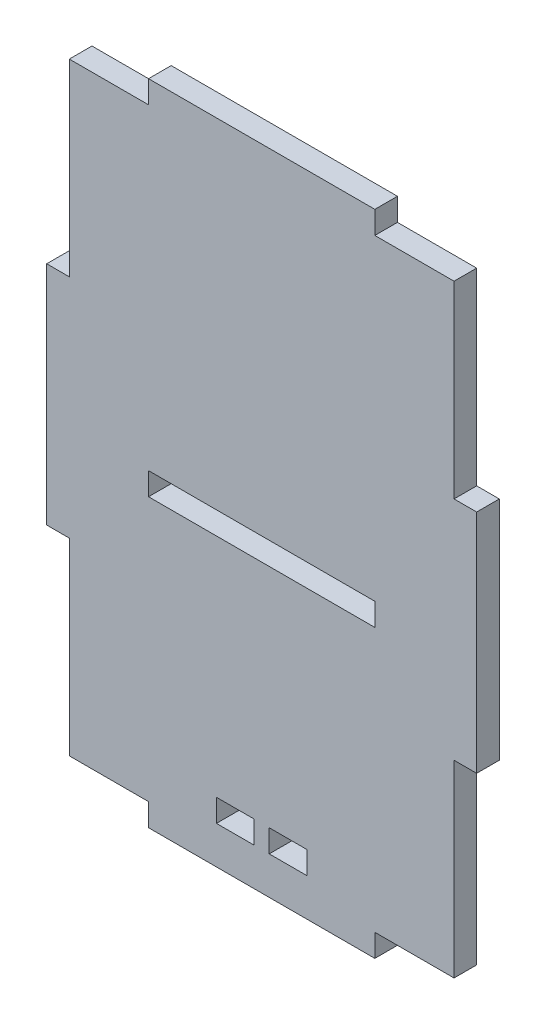
ISO-10303-21;
HEADER;
FILE_DESCRIPTION(('STEP AP214'),'2;1');
FILE_NAME('part.step','',(''),(''),'','','');
FILE_SCHEMA(('AUTOMOTIVE_DESIGN { 1 0 10303 214 1 1 1 1 }'));
ENDSEC;
DATA;
#1=APPLICATION_CONTEXT('core data for automotive mechanical design processes');
#2=APPLICATION_PROTOCOL_DEFINITION('international standard','automotive_design',2000,#1);
#3=PRODUCT_CONTEXT('',#1,'mechanical');
#4=PRODUCT('Part','Part','',(#3));
#5=PRODUCT_RELATED_PRODUCT_CATEGORY('part','',(#4));
#6=PRODUCT_DEFINITION_FORMATION('','',#4);
#7=PRODUCT_DEFINITION_CONTEXT('part definition',#1,'design');
#8=PRODUCT_DEFINITION('design','',#6,#7);
#9=PRODUCT_DEFINITION_SHAPE('','',#8);
#10=(LENGTH_UNIT() NAMED_UNIT(*) SI_UNIT(.MILLI.,.METRE.));
#11=(NAMED_UNIT(*) PLANE_ANGLE_UNIT() SI_UNIT($,.RADIAN.));
#12=(NAMED_UNIT(*) SI_UNIT($,.STERADIAN.) SOLID_ANGLE_UNIT());
#13=UNCERTAINTY_MEASURE_WITH_UNIT(LENGTH_MEASURE(1.E-05),#10,'distance_accuracy_value','');
#14=(GEOMETRIC_REPRESENTATION_CONTEXT(3) GLOBAL_UNCERTAINTY_ASSIGNED_CONTEXT((#13)) GLOBAL_UNIT_ASSIGNED_CONTEXT((#10,
#11,#12)) REPRESENTATION_CONTEXT('',''));
#15=CARTESIAN_POINT('',(0.,0.,0.));
#16=DIRECTION('',(0.,0.,1.));
#17=DIRECTION('',(1.,0.,0.));
#18=AXIS2_PLACEMENT_3D('',#15,#16,#17);
#19=CARTESIAN_POINT('',(0.,0.,1.5));
#20=DIRECTION('',(0.,0.,1.));
#21=DIRECTION('',(1.,0.,0.));
#22=AXIS2_PLACEMENT_3D('',#19,#20,#21);
#23=PLANE('',#22);
#24=DIRECTION('',(0.,1.,0.));
#25=VECTOR('',#24,1.);
#26=CARTESIAN_POINT('',(25.5,-15.,1.5));
#27=LINE('',#26,#25);
#28=CARTESIAN_POINT('',(25.5,-40.,1.5));
#29=VERTEX_POINT('',#28);
#30=CARTESIAN_POINT('',(25.5,-15.,1.5));
#31=VERTEX_POINT('',#30);
#32=EDGE_CURVE('E339',#29,#31,#27,.T.);
#33=ORIENTED_EDGE('',*,*,#32,.T.);
#34=DIRECTION('',(1.,0.,0.));
#35=VECTOR('',#34,1.);
#36=CARTESIAN_POINT('',(25.5,-15.,1.5));
#37=LINE('',#36,#35);
#38=CARTESIAN_POINT('',(28.5,-15.,1.5));
#39=VERTEX_POINT('',#38);
#40=EDGE_CURVE('E342',#31,#39,#37,.T.);
#41=ORIENTED_EDGE('',*,*,#40,.T.);
#42=DIRECTION('',(0.,1.,0.));
#43=VECTOR('',#42,1.);
#44=CARTESIAN_POINT('',(28.5,15.,1.5));
#45=LINE('',#44,#43);
#46=CARTESIAN_POINT('',(28.5,15.,1.5));
#47=VERTEX_POINT('',#46);
#48=EDGE_CURVE('E345',#39,#47,#45,.T.);
#49=ORIENTED_EDGE('',*,*,#48,.T.);
#50=DIRECTION('',(-1.,0.,0.));
#51=VECTOR('',#50,1.);
#52=CARTESIAN_POINT('',(25.5,15.,1.5));
#53=LINE('',#52,#51);
#54=CARTESIAN_POINT('',(25.5,15.,1.5));
#55=VERTEX_POINT('',#54);
#56=EDGE_CURVE('E347',#47,#55,#53,.T.);
#57=ORIENTED_EDGE('',*,*,#56,.T.);
#58=DIRECTION('',(0.,1.,0.));
#59=VECTOR('',#58,1.);
#60=CARTESIAN_POINT('',(25.5,40.,1.5));
#61=LINE('',#60,#59);
#62=CARTESIAN_POINT('',(25.5,40.,1.5));
#63=VERTEX_POINT('',#62);
#64=EDGE_CURVE('E349',#55,#63,#61,.T.);
#65=ORIENTED_EDGE('',*,*,#64,.T.);
#66=DIRECTION('',(-1.,0.,0.));
#67=VECTOR('',#66,1.);
#68=CARTESIAN_POINT('',(15.,40.,1.5));
#69=LINE('',#68,#67);
#70=CARTESIAN_POINT('',(15.,40.,1.5));
#71=VERTEX_POINT('',#70);
#72=EDGE_CURVE('E351',#63,#71,#69,.T.);
#73=ORIENTED_EDGE('',*,*,#72,.T.);
#74=DIRECTION('',(0.,1.,0.));
#75=VECTOR('',#74,1.);
#76=CARTESIAN_POINT('',(15.,40.,1.5));
#77=LINE('',#76,#75);
#78=CARTESIAN_POINT('',(15.,43.,1.5));
#79=VERTEX_POINT('',#78);
#80=EDGE_CURVE('E353',#71,#79,#77,.T.);
#81=ORIENTED_EDGE('',*,*,#80,.T.);
#82=DIRECTION('',(-1.,0.,0.));
#83=VECTOR('',#82,1.);
#84=CARTESIAN_POINT('',(-15.,43.,1.5));
#85=LINE('',#84,#83);
#86=CARTESIAN_POINT('',(-15.,43.,1.5));
#87=VERTEX_POINT('',#86);
#88=EDGE_CURVE('E355',#79,#87,#85,.T.);
#89=ORIENTED_EDGE('',*,*,#88,.T.);
#90=DIRECTION('',(0.,-1.,0.));
#91=VECTOR('',#90,1.);
#92=CARTESIAN_POINT('',(-15.,40.,1.5));
#93=LINE('',#92,#91);
#94=CARTESIAN_POINT('',(-15.,40.,1.5));
#95=VERTEX_POINT('',#94);
#96=EDGE_CURVE('E357',#87,#95,#93,.T.);
#97=ORIENTED_EDGE('',*,*,#96,.T.);
#98=DIRECTION('',(-1.,0.,0.));
#99=VECTOR('',#98,1.);
#100=CARTESIAN_POINT('',(-25.5,40.,1.5));
#101=LINE('',#100,#99);
#102=CARTESIAN_POINT('',(-25.5,40.,1.5));
#103=VERTEX_POINT('',#102);
#104=EDGE_CURVE('E359',#95,#103,#101,.T.);
#105=ORIENTED_EDGE('',*,*,#104,.T.);
#106=DIRECTION('',(0.,-1.,0.));
#107=VECTOR('',#106,1.);
#108=CARTESIAN_POINT('',(-25.5,40.,1.5));
#109=LINE('',#108,#107);
#110=CARTESIAN_POINT('',(-25.5,15.,1.5));
#111=VERTEX_POINT('',#110);
#112=EDGE_CURVE('E361',#103,#111,#109,.T.);
#113=ORIENTED_EDGE('',*,*,#112,.T.);
#114=DIRECTION('',(-1.,0.,0.));
#115=VECTOR('',#114,1.);
#116=CARTESIAN_POINT('',(-25.5,15.,1.5));
#117=LINE('',#116,#115);
#118=CARTESIAN_POINT('',(-28.5,15.,1.5));
#119=VERTEX_POINT('',#118);
#120=EDGE_CURVE('E363',#111,#119,#117,.T.);
#121=ORIENTED_EDGE('',*,*,#120,.T.);
#122=DIRECTION('',(0.,-1.,0.));
#123=VECTOR('',#122,1.);
#124=CARTESIAN_POINT('',(-28.5,15.,1.5));
#125=LINE('',#124,#123);
#126=CARTESIAN_POINT('',(-28.5,-15.,1.5));
#127=VERTEX_POINT('',#126);
#128=EDGE_CURVE('E365',#119,#127,#125,.T.);
#129=ORIENTED_EDGE('',*,*,#128,.T.);
#130=DIRECTION('',(1.,0.,0.));
#131=VECTOR('',#130,1.);
#132=CARTESIAN_POINT('',(-25.5,-15.,1.5));
#133=LINE('',#132,#131);
#134=CARTESIAN_POINT('',(-25.5,-15.,1.5));
#135=VERTEX_POINT('',#134);
#136=EDGE_CURVE('E367',#127,#135,#133,.T.);
#137=ORIENTED_EDGE('',*,*,#136,.T.);
#138=DIRECTION('',(0.,-1.,0.));
#139=VECTOR('',#138,1.);
#140=CARTESIAN_POINT('',(-25.5,-15.,1.5));
#141=LINE('',#140,#139);
#142=CARTESIAN_POINT('',(-25.5,-40.,1.5));
#143=VERTEX_POINT('',#142);
#144=EDGE_CURVE('E369',#135,#143,#141,.T.);
#145=ORIENTED_EDGE('',*,*,#144,.T.);
#146=DIRECTION('',(1.,0.,0.));
#147=VECTOR('',#146,1.);
#148=CARTESIAN_POINT('',(-25.5,-40.,1.5));
#149=LINE('',#148,#147);
#150=CARTESIAN_POINT('',(-15.,-40.,1.5));
#151=VERTEX_POINT('',#150);
#152=EDGE_CURVE('E371',#143,#151,#149,.T.);
#153=ORIENTED_EDGE('',*,*,#152,.T.);
#154=DIRECTION('',(0.,-1.,0.));
#155=VECTOR('',#154,1.);
#156=CARTESIAN_POINT('',(-15.,-40.,1.5));
#157=LINE('',#156,#155);
#158=CARTESIAN_POINT('',(-15.,-43.,1.5));
#159=VERTEX_POINT('',#158);
#160=EDGE_CURVE('E373',#151,#159,#157,.T.);
#161=ORIENTED_EDGE('',*,*,#160,.T.);
#162=DIRECTION('',(1.,0.,0.));
#163=VECTOR('',#162,1.);
#164=CARTESIAN_POINT('',(-15.,-43.,1.5));
#165=LINE('',#164,#163);
#166=CARTESIAN_POINT('',(15.,-43.,1.5));
#167=VERTEX_POINT('',#166);
#168=EDGE_CURVE('E375',#159,#167,#165,.T.);
#169=ORIENTED_EDGE('',*,*,#168,.T.);
#170=DIRECTION('',(0.,1.,0.));
#171=VECTOR('',#170,1.);
#172=CARTESIAN_POINT('',(15.,-40.,1.5));
#173=LINE('',#172,#171);
#174=CARTESIAN_POINT('',(15.,-40.,1.5));
#175=VERTEX_POINT('',#174);
#176=EDGE_CURVE('E377',#167,#175,#173,.T.);
#177=ORIENTED_EDGE('',*,*,#176,.T.);
#178=DIRECTION('',(1.,0.,0.));
#179=VECTOR('',#178,1.);
#180=CARTESIAN_POINT('',(15.,-40.,1.5));
#181=LINE('',#180,#179);
#182=EDGE_CURVE('E379',#175,#29,#181,.T.);
#183=ORIENTED_EDGE('',*,*,#182,.T.);
#184=EDGE_LOOP('',(#33,#41,#49,#57,#65,#73,#81,#89,#97,#105,#113,#121,#129,#137,#145,#153,#161,
#169,#177,#183));
#185=FACE_BOUND('',#184,.T.);
#186=DIRECTION('',(1.,0.,0.));
#187=VECTOR('',#186,1.);
#188=CARTESIAN_POINT('',(-15.,-5.,1.5));
#189=LINE('',#188,#187);
#190=CARTESIAN_POINT('',(-15.,-5.,1.5));
#191=VERTEX_POINT('',#190);
#192=CARTESIAN_POINT('',(15.,-5.,1.5));
#193=VERTEX_POINT('',#192);
#194=EDGE_CURVE('E310',#191,#193,#189,.T.);
#195=ORIENTED_EDGE('',*,*,#194,.F.);
#196=DIRECTION('',(0.,-1.,0.));
#197=VECTOR('',#196,1.);
#198=CARTESIAN_POINT('',(-15.,-2.,1.5));
#199=LINE('',#198,#197);
#200=CARTESIAN_POINT('',(-15.,-2.,1.5));
#201=VERTEX_POINT('',#200);
#202=EDGE_CURVE('E308',#201,#191,#199,.T.);
#203=ORIENTED_EDGE('',*,*,#202,.F.);
#204=DIRECTION('',(-1.,0.,0.));
#205=VECTOR('',#204,1.);
#206=CARTESIAN_POINT('',(-15.,-2.,1.5));
#207=LINE('',#206,#205);
#208=CARTESIAN_POINT('',(15.,-2.,1.5));
#209=VERTEX_POINT('',#208);
#210=EDGE_CURVE('E316',#209,#201,#207,.T.);
#211=ORIENTED_EDGE('',*,*,#210,.F.);
#212=DIRECTION('',(0.,1.,0.));
#213=VECTOR('',#212,1.);
#214=CARTESIAN_POINT('',(15.,-2.,1.5));
#215=LINE('',#214,#213);
#216=EDGE_CURVE('E313',#193,#209,#215,.T.);
#217=ORIENTED_EDGE('',*,*,#216,.F.);
#218=EDGE_LOOP('',(#195,#203,#211,#217));
#219=FACE_BOUND('',#218,.T.);
#220=DIRECTION('',(1.,0.,0.));
#221=VECTOR('',#220,1.);
#222=CARTESIAN_POINT('',(0.999999999999997,-38.,1.5));
#223=LINE('',#222,#221);
#224=CARTESIAN_POINT('',(0.999999999999997,-38.,1.5));
#225=VERTEX_POINT('',#224);
#226=CARTESIAN_POINT('',(6.,-38.,1.5));
#227=VERTEX_POINT('',#226);
#228=EDGE_CURVE('E279',#225,#227,#223,.T.);
#229=ORIENTED_EDGE('',*,*,#228,.F.);
#230=DIRECTION('',(0.,-1.,0.));
#231=VECTOR('',#230,1.);
#232=CARTESIAN_POINT('',(0.999999999999997,-38.,1.5));
#233=LINE('',#232,#231);
#234=CARTESIAN_POINT('',(0.999999999999997,-35.,1.5));
#235=VERTEX_POINT('',#234);
#236=EDGE_CURVE('E277',#235,#225,#233,.T.);
#237=ORIENTED_EDGE('',*,*,#236,.F.);
#238=DIRECTION('',(-1.,0.,0.));
#239=VECTOR('',#238,1.);
#240=CARTESIAN_POINT('',(0.999999999999997,-35.,1.5));
#241=LINE('',#240,#239);
#242=CARTESIAN_POINT('',(6.,-35.,1.5));
#243=VERTEX_POINT('',#242);
#244=EDGE_CURVE('E285',#243,#235,#241,.T.);
#245=ORIENTED_EDGE('',*,*,#244,.F.);
#246=DIRECTION('',(0.,1.,0.));
#247=VECTOR('',#246,1.);
#248=CARTESIAN_POINT('',(6.,-38.,1.5));
#249=LINE('',#248,#247);
#250=EDGE_CURVE('E282',#227,#243,#249,.T.);
#251=ORIENTED_EDGE('',*,*,#250,.F.);
#252=EDGE_LOOP('',(#229,#237,#245,#251));
#253=FACE_BOUND('',#252,.T.);
#254=DIRECTION('',(-1.,0.,0.));
#255=VECTOR('',#254,1.);
#256=CARTESIAN_POINT('',(-1.,-35.,1.5));
#257=LINE('',#256,#255);
#258=CARTESIAN_POINT('',(-1.,-35.,1.5));
#259=VERTEX_POINT('',#258);
#260=CARTESIAN_POINT('',(-6.,-35.,1.5));
#261=VERTEX_POINT('',#260);
#262=EDGE_CURVE('E249',#259,#261,#257,.T.);
#263=ORIENTED_EDGE('',*,*,#262,.F.);
#264=DIRECTION('',(0.,1.,0.));
#265=VECTOR('',#264,1.);
#266=CARTESIAN_POINT('',(-1.,-35.,1.5));
#267=LINE('',#266,#265);
#268=CARTESIAN_POINT('',(-1.,-38.,1.5));
#269=VERTEX_POINT('',#268);
#270=EDGE_CURVE('E241',#269,#259,#267,.T.);
#271=ORIENTED_EDGE('',*,*,#270,.F.);
#272=DIRECTION('',(1.,0.,0.));
#273=VECTOR('',#272,1.);
#274=CARTESIAN_POINT('',(-1.,-38.,1.5));
#275=LINE('',#274,#273);
#276=CARTESIAN_POINT('',(-6.,-38.,1.5));
#277=VERTEX_POINT('',#276);
#278=EDGE_CURVE('E263',#277,#269,#275,.T.);
#279=ORIENTED_EDGE('',*,*,#278,.F.);
#280=DIRECTION('',(0.,-1.,0.));
#281=VECTOR('',#280,1.);
#282=CARTESIAN_POINT('',(-6.,-35.,1.5));
#283=LINE('',#282,#281);
#284=EDGE_CURVE('E261',#261,#277,#283,.T.);
#285=ORIENTED_EDGE('',*,*,#284,.F.);
#286=EDGE_LOOP('',(#263,#271,#279,#285));
#287=FACE_BOUND('',#286,.T.);
#288=ADVANCED_FACE('F32',(#185,#219,#253,#287),#23,.T.);
#289=CARTESIAN_POINT('',(0.,0.,-1.5));
#290=DIRECTION('',(0.,0.,1.));
#291=DIRECTION('',(1.,0.,0.));
#292=AXIS2_PLACEMENT_3D('',#289,#290,#291);
#293=PLANE('',#292);
#294=DIRECTION('',(0.,-1.,0.));
#295=VECTOR('',#294,1.);
#296=CARTESIAN_POINT('',(0.999999999999997,-38.,-1.5));
#297=LINE('',#296,#295);
#298=CARTESIAN_POINT('',(0.999999999999997,-35.,-1.5));
#299=VERTEX_POINT('',#298);
#300=CARTESIAN_POINT('',(0.999999999999997,-38.,-1.5));
#301=VERTEX_POINT('',#300);
#302=EDGE_CURVE('E257',#299,#301,#297,.T.);
#303=ORIENTED_EDGE('',*,*,#302,.T.);
#304=DIRECTION('',(1.,0.,0.));
#305=VECTOR('',#304,1.);
#306=CARTESIAN_POINT('',(0.999999999999997,-38.,-1.5));
#307=LINE('',#306,#305);
#308=CARTESIAN_POINT('',(6.,-38.,-1.5));
#309=VERTEX_POINT('',#308);
#310=EDGE_CURVE('E290',#301,#309,#307,.T.);
#311=ORIENTED_EDGE('',*,*,#310,.T.);
#312=DIRECTION('',(0.,1.,0.));
#313=VECTOR('',#312,1.);
#314=CARTESIAN_POINT('',(6.,-38.,-1.5));
#315=LINE('',#314,#313);
#316=CARTESIAN_POINT('',(6.,-35.,-1.5));
#317=VERTEX_POINT('',#316);
#318=EDGE_CURVE('E293',#309,#317,#315,.T.);
#319=ORIENTED_EDGE('',*,*,#318,.T.);
#320=DIRECTION('',(-1.,0.,0.));
#321=VECTOR('',#320,1.);
#322=CARTESIAN_POINT('',(0.999999999999997,-35.,-1.5));
#323=LINE('',#322,#321);
#324=EDGE_CURVE('E280',#317,#299,#323,.T.);
#325=ORIENTED_EDGE('',*,*,#324,.T.);
#326=EDGE_LOOP('',(#303,#311,#319,#325));
#327=FACE_BOUND('',#326,.T.);
#328=DIRECTION('',(0.,1.,0.));
#329=VECTOR('',#328,1.);
#330=CARTESIAN_POINT('',(25.5,-15.,-1.5));
#331=LINE('',#330,#329);
#332=CARTESIAN_POINT('',(25.5,-40.,-1.5));
#333=VERTEX_POINT('',#332);
#334=CARTESIAN_POINT('',(25.5,-15.,-1.5));
#335=VERTEX_POINT('',#334);
#336=EDGE_CURVE('E338',#333,#335,#331,.T.);
#337=ORIENTED_EDGE('',*,*,#336,.F.);
#338=DIRECTION('',(1.,0.,0.));
#339=VECTOR('',#338,1.);
#340=CARTESIAN_POINT('',(15.,-40.,-1.5));
#341=LINE('',#340,#339);
#342=CARTESIAN_POINT('',(15.,-40.,-1.5));
#343=VERTEX_POINT('',#342);
#344=EDGE_CURVE('E343',#343,#333,#341,.T.);
#345=ORIENTED_EDGE('',*,*,#344,.F.);
#346=DIRECTION('',(0.,1.,0.));
#347=VECTOR('',#346,1.);
#348=CARTESIAN_POINT('',(15.,-40.,-1.5));
#349=LINE('',#348,#347);
#350=CARTESIAN_POINT('',(15.,-43.,-1.5));
#351=VERTEX_POINT('',#350);
#352=EDGE_CURVE('E418',#351,#343,#349,.T.);
#353=ORIENTED_EDGE('',*,*,#352,.F.);
#354=DIRECTION('',(1.,0.,0.));
#355=VECTOR('',#354,1.);
#356=CARTESIAN_POINT('',(-15.,-43.,-1.5));
#357=LINE('',#356,#355);
#358=CARTESIAN_POINT('',(-15.,-43.,-1.5));
#359=VERTEX_POINT('',#358);
#360=EDGE_CURVE('E416',#359,#351,#357,.T.);
#361=ORIENTED_EDGE('',*,*,#360,.F.);
#362=DIRECTION('',(0.,-1.,0.));
#363=VECTOR('',#362,1.);
#364=CARTESIAN_POINT('',(-15.,-40.,-1.5));
#365=LINE('',#364,#363);
#366=CARTESIAN_POINT('',(-15.,-40.,-1.5));
#367=VERTEX_POINT('',#366);
#368=EDGE_CURVE('E414',#367,#359,#365,.T.);
#369=ORIENTED_EDGE('',*,*,#368,.F.);
#370=DIRECTION('',(1.,0.,0.));
#371=VECTOR('',#370,1.);
#372=CARTESIAN_POINT('',(-25.5,-40.,-1.5));
#373=LINE('',#372,#371);
#374=CARTESIAN_POINT('',(-25.5,-40.,-1.5));
#375=VERTEX_POINT('',#374);
#376=EDGE_CURVE('E412',#375,#367,#373,.T.);
#377=ORIENTED_EDGE('',*,*,#376,.F.);
#378=DIRECTION('',(0.,-1.,0.));
#379=VECTOR('',#378,1.);
#380=CARTESIAN_POINT('',(-25.5,-15.,-1.5));
#381=LINE('',#380,#379);
#382=CARTESIAN_POINT('',(-25.5,-15.,-1.5));
#383=VERTEX_POINT('',#382);
#384=EDGE_CURVE('E410',#383,#375,#381,.T.);
#385=ORIENTED_EDGE('',*,*,#384,.F.);
#386=DIRECTION('',(1.,0.,0.));
#387=VECTOR('',#386,1.);
#388=CARTESIAN_POINT('',(-25.5,-15.,-1.5));
#389=LINE('',#388,#387);
#390=CARTESIAN_POINT('',(-28.5,-15.,-1.5));
#391=VERTEX_POINT('',#390);
#392=EDGE_CURVE('E408',#391,#383,#389,.T.);
#393=ORIENTED_EDGE('',*,*,#392,.F.);
#394=DIRECTION('',(0.,-1.,0.));
#395=VECTOR('',#394,1.);
#396=CARTESIAN_POINT('',(-28.5,15.,-1.5));
#397=LINE('',#396,#395);
#398=CARTESIAN_POINT('',(-28.5,15.,-1.5));
#399=VERTEX_POINT('',#398);
#400=EDGE_CURVE('E406',#399,#391,#397,.T.);
#401=ORIENTED_EDGE('',*,*,#400,.F.);
#402=DIRECTION('',(-1.,0.,0.));
#403=VECTOR('',#402,1.);
#404=CARTESIAN_POINT('',(-25.5,15.,-1.5));
#405=LINE('',#404,#403);
#406=CARTESIAN_POINT('',(-25.5,15.,-1.5));
#407=VERTEX_POINT('',#406);
#408=EDGE_CURVE('E404',#407,#399,#405,.T.);
#409=ORIENTED_EDGE('',*,*,#408,.F.);
#410=DIRECTION('',(0.,-1.,0.));
#411=VECTOR('',#410,1.);
#412=CARTESIAN_POINT('',(-25.5,40.,-1.5));
#413=LINE('',#412,#411);
#414=CARTESIAN_POINT('',(-25.5,40.,-1.5));
#415=VERTEX_POINT('',#414);
#416=EDGE_CURVE('E402',#415,#407,#413,.T.);
#417=ORIENTED_EDGE('',*,*,#416,.F.);
#418=DIRECTION('',(-1.,0.,0.));
#419=VECTOR('',#418,1.);
#420=CARTESIAN_POINT('',(-25.5,40.,-1.5));
#421=LINE('',#420,#419);
#422=CARTESIAN_POINT('',(-15.,40.,-1.5));
#423=VERTEX_POINT('',#422);
#424=EDGE_CURVE('E400',#423,#415,#421,.T.);
#425=ORIENTED_EDGE('',*,*,#424,.F.);
#426=DIRECTION('',(0.,-1.,0.));
#427=VECTOR('',#426,1.);
#428=CARTESIAN_POINT('',(-15.,40.,-1.5));
#429=LINE('',#428,#427);
#430=CARTESIAN_POINT('',(-15.,43.,-1.5));
#431=VERTEX_POINT('',#430);
#432=EDGE_CURVE('E398',#431,#423,#429,.T.);
#433=ORIENTED_EDGE('',*,*,#432,.F.);
#434=DIRECTION('',(-1.,0.,0.));
#435=VECTOR('',#434,1.);
#436=CARTESIAN_POINT('',(-15.,43.,-1.5));
#437=LINE('',#436,#435);
#438=CARTESIAN_POINT('',(15.,43.,-1.5));
#439=VERTEX_POINT('',#438);
#440=EDGE_CURVE('E396',#439,#431,#437,.T.);
#441=ORIENTED_EDGE('',*,*,#440,.F.);
#442=DIRECTION('',(0.,1.,0.));
#443=VECTOR('',#442,1.);
#444=CARTESIAN_POINT('',(15.,40.,-1.5));
#445=LINE('',#444,#443);
#446=CARTESIAN_POINT('',(15.,40.,-1.5));
#447=VERTEX_POINT('',#446);
#448=EDGE_CURVE('E394',#447,#439,#445,.T.);
#449=ORIENTED_EDGE('',*,*,#448,.F.);
#450=DIRECTION('',(-1.,0.,0.));
#451=VECTOR('',#450,1.);
#452=CARTESIAN_POINT('',(15.,40.,-1.5));
#453=LINE('',#452,#451);
#454=CARTESIAN_POINT('',(25.5,40.,-1.5));
#455=VERTEX_POINT('',#454);
#456=EDGE_CURVE('E392',#455,#447,#453,.T.);
#457=ORIENTED_EDGE('',*,*,#456,.F.);
#458=DIRECTION('',(0.,1.,0.));
#459=VECTOR('',#458,1.);
#460=CARTESIAN_POINT('',(25.5,40.,-1.5));
#461=LINE('',#460,#459);
#462=CARTESIAN_POINT('',(25.5,15.,-1.5));
#463=VERTEX_POINT('',#462);
#464=EDGE_CURVE('E390',#463,#455,#461,.T.);
#465=ORIENTED_EDGE('',*,*,#464,.F.);
#466=DIRECTION('',(-1.,0.,0.));
#467=VECTOR('',#466,1.);
#468=CARTESIAN_POINT('',(25.5,15.,-1.5));
#469=LINE('',#468,#467);
#470=CARTESIAN_POINT('',(28.5,15.,-1.5));
#471=VERTEX_POINT('',#470);
#472=EDGE_CURVE('E388',#471,#463,#469,.T.);
#473=ORIENTED_EDGE('',*,*,#472,.F.);
#474=DIRECTION('',(0.,1.,0.));
#475=VECTOR('',#474,1.);
#476=CARTESIAN_POINT('',(28.5,15.,-1.5));
#477=LINE('',#476,#475);
#478=CARTESIAN_POINT('',(28.5,-15.,-1.5));
#479=VERTEX_POINT('',#478);
#480=EDGE_CURVE('E386',#479,#471,#477,.T.);
#481=ORIENTED_EDGE('',*,*,#480,.F.);
#482=DIRECTION('',(1.,0.,0.));
#483=VECTOR('',#482,1.);
#484=CARTESIAN_POINT('',(25.5,-15.,-1.5));
#485=LINE('',#484,#483);
#486=EDGE_CURVE('E384',#335,#479,#485,.T.);
#487=ORIENTED_EDGE('',*,*,#486,.F.);
#488=EDGE_LOOP('',(#337,#345,#353,#361,#369,#377,#385,#393,#401,#409,#417,#425,#433,#441,#449,
#457,#465,#473,#481,#487));
#489=FACE_BOUND('',#488,.T.);
#490=DIRECTION('',(0.,-1.,0.));
#491=VECTOR('',#490,1.);
#492=CARTESIAN_POINT('',(-15.,-2.,-1.5));
#493=LINE('',#492,#491);
#494=CARTESIAN_POINT('',(-15.,-2.,-1.5));
#495=VERTEX_POINT('',#494);
#496=CARTESIAN_POINT('',(-15.,-5.,-1.5));
#497=VERTEX_POINT('',#496);
#498=EDGE_CURVE('E307',#495,#497,#493,.T.);
#499=ORIENTED_EDGE('',*,*,#498,.T.);
#500=DIRECTION('',(1.,0.,0.));
#501=VECTOR('',#500,1.);
#502=CARTESIAN_POINT('',(-15.,-5.,-1.5));
#503=LINE('',#502,#501);
#504=CARTESIAN_POINT('',(15.,-5.,-1.5));
#505=VERTEX_POINT('',#504);
#506=EDGE_CURVE('E321',#497,#505,#503,.T.);
#507=ORIENTED_EDGE('',*,*,#506,.T.);
#508=DIRECTION('',(0.,1.,0.));
#509=VECTOR('',#508,1.);
#510=CARTESIAN_POINT('',(15.,-2.,-1.5));
#511=LINE('',#510,#509);
#512=CARTESIAN_POINT('',(15.,-2.,-1.5));
#513=VERTEX_POINT('',#512);
#514=EDGE_CURVE('E324',#505,#513,#511,.T.);
#515=ORIENTED_EDGE('',*,*,#514,.T.);
#516=DIRECTION('',(-1.,0.,0.));
#517=VECTOR('',#516,1.);
#518=CARTESIAN_POINT('',(-15.,-2.,-1.5));
#519=LINE('',#518,#517);
#520=EDGE_CURVE('E311',#513,#495,#519,.T.);
#521=ORIENTED_EDGE('',*,*,#520,.T.);
#522=EDGE_LOOP('',(#499,#507,#515,#521));
#523=FACE_BOUND('',#522,.T.);
#524=DIRECTION('',(0.,1.,0.));
#525=VECTOR('',#524,1.);
#526=CARTESIAN_POINT('',(-1.,-35.,-1.5));
#527=LINE('',#526,#525);
#528=CARTESIAN_POINT('',(-1.,-38.,-1.5));
#529=VERTEX_POINT('',#528);
#530=CARTESIAN_POINT('',(-1.,-35.,-1.5));
#531=VERTEX_POINT('',#530);
#532=EDGE_CURVE('E55',#529,#531,#527,.T.);
#533=ORIENTED_EDGE('',*,*,#532,.T.);
#534=DIRECTION('',(-1.,0.,0.));
#535=VECTOR('',#534,1.);
#536=CARTESIAN_POINT('',(-1.,-35.,-1.5));
#537=LINE('',#536,#535);
#538=CARTESIAN_POINT('',(-6.,-35.,-1.5));
#539=VERTEX_POINT('',#538);
#540=EDGE_CURVE('E256',#531,#539,#537,.T.);
#541=ORIENTED_EDGE('',*,*,#540,.T.);
#542=DIRECTION('',(0.,-1.,0.));
#543=VECTOR('',#542,1.);
#544=CARTESIAN_POINT('',(-6.,-35.,-1.5));
#545=LINE('',#544,#543);
#546=CARTESIAN_POINT('',(-6.,-38.,-1.5));
#547=VERTEX_POINT('',#546);
#548=EDGE_CURVE('E269',#539,#547,#545,.T.);
#549=ORIENTED_EDGE('',*,*,#548,.T.);
#550=DIRECTION('',(1.,0.,0.));
#551=VECTOR('',#550,1.);
#552=CARTESIAN_POINT('',(-1.,-38.,-1.5));
#553=LINE('',#552,#551);
#554=EDGE_CURVE('E250',#547,#529,#553,.T.);
#555=ORIENTED_EDGE('',*,*,#554,.T.);
#556=EDGE_LOOP('',(#533,#541,#549,#555));
#557=FACE_BOUND('',#556,.T.);
#558=ADVANCED_FACE('F484',(#327,#489,#523,#557),#293,.F.);
#559=CARTESIAN_POINT('',(25.5,-15.,1.5));
#560=DIRECTION('',(-1.,0.,0.));
#561=DIRECTION('',(0.,-1.,0.));
#562=AXIS2_PLACEMENT_3D('',#559,#560,#561);
#563=PLANE('',#562);
#564=ORIENTED_EDGE('',*,*,#336,.T.);
#565=DIRECTION('',(0.,0.,-1.));
#566=VECTOR('',#565,1.);
#567=CARTESIAN_POINT('',(25.5,-15.,1.5));
#568=LINE('',#567,#566);
#569=EDGE_CURVE('E11',#31,#335,#568,.T.);
#570=ORIENTED_EDGE('',*,*,#569,.F.);
#571=ORIENTED_EDGE('',*,*,#32,.F.);
#572=DIRECTION('',(0.,0.,-1.));
#573=VECTOR('',#572,1.);
#574=CARTESIAN_POINT('',(25.5,-40.,1.5));
#575=LINE('',#574,#573);
#576=EDGE_CURVE('E381',#29,#333,#575,.T.);
#577=ORIENTED_EDGE('',*,*,#576,.T.);
#578=EDGE_LOOP('',(#564,#570,#571,#577));
#579=FACE_BOUND('',#578,.T.);
#580=ADVANCED_FACE('F34',(#579),#563,.F.);
#581=CARTESIAN_POINT('',(25.5,-15.,1.5));
#582=DIRECTION('',(0.,1.,0.));
#583=DIRECTION('',(0.,0.,1.));
#584=AXIS2_PLACEMENT_3D('',#581,#582,#583);
#585=PLANE('',#584);
#586=ORIENTED_EDGE('',*,*,#486,.T.);
#587=DIRECTION('',(0.,0.,-1.));
#588=VECTOR('',#587,1.);
#589=CARTESIAN_POINT('',(28.5,-15.,1.5));
#590=LINE('',#589,#588);
#591=EDGE_CURVE('E40',#39,#479,#590,.T.);
#592=ORIENTED_EDGE('',*,*,#591,.F.);
#593=ORIENTED_EDGE('',*,*,#40,.F.);
#594=ORIENTED_EDGE('',*,*,#569,.T.);
#595=EDGE_LOOP('',(#586,#592,#593,#594));
#596=FACE_BOUND('',#595,.T.);
#597=ADVANCED_FACE('F502',(#596),#585,.F.);
#598=CARTESIAN_POINT('',(28.5,15.,1.5));
#599=DIRECTION('',(-1.,0.,0.));
#600=DIRECTION('',(0.,-1.,0.));
#601=AXIS2_PLACEMENT_3D('',#598,#599,#600);
#602=PLANE('',#601);
#603=ORIENTED_EDGE('',*,*,#480,.T.);
#604=DIRECTION('',(0.,0.,-1.));
#605=VECTOR('',#604,1.);
#606=CARTESIAN_POINT('',(28.5,15.,1.5));
#607=LINE('',#606,#605);
#608=EDGE_CURVE('E471',#47,#471,#607,.T.);
#609=ORIENTED_EDGE('',*,*,#608,.F.);
#610=ORIENTED_EDGE('',*,*,#48,.F.);
#611=ORIENTED_EDGE('',*,*,#591,.T.);
#612=EDGE_LOOP('',(#603,#609,#610,#611));
#613=FACE_BOUND('',#612,.T.);
#614=ADVANCED_FACE('F478',(#613),#602,.F.);
#615=CARTESIAN_POINT('',(25.5,15.,1.5));
#616=DIRECTION('',(0.,-1.,0.));
#617=DIRECTION('',(1.,0.,0.));
#618=AXIS2_PLACEMENT_3D('',#615,#616,#617);
#619=PLANE('',#618);
#620=ORIENTED_EDGE('',*,*,#472,.T.);
#621=DIRECTION('',(0.,0.,-1.));
#622=VECTOR('',#621,1.);
#623=CARTESIAN_POINT('',(25.5,15.,1.5));
#624=LINE('',#623,#622);
#625=EDGE_CURVE('E468',#55,#463,#624,.T.);
#626=ORIENTED_EDGE('',*,*,#625,.F.);
#627=ORIENTED_EDGE('',*,*,#56,.F.);
#628=ORIENTED_EDGE('',*,*,#608,.T.);
#629=EDGE_LOOP('',(#620,#626,#627,#628));
#630=FACE_BOUND('',#629,.T.);
#631=ADVANCED_FACE('F490',(#630),#619,.F.);
#632=CARTESIAN_POINT('',(25.5,40.,1.5));
#633=DIRECTION('',(-1.,0.,0.));
#634=DIRECTION('',(0.,-1.,0.));
#635=AXIS2_PLACEMENT_3D('',#632,#633,#634);
#636=PLANE('',#635);
#637=ORIENTED_EDGE('',*,*,#464,.T.);
#638=DIRECTION('',(0.,0.,-1.));
#639=VECTOR('',#638,1.);
#640=CARTESIAN_POINT('',(25.5,40.,1.5));
#641=LINE('',#640,#639);
#642=EDGE_CURVE('E465',#63,#455,#641,.T.);
#643=ORIENTED_EDGE('',*,*,#642,.F.);
#644=ORIENTED_EDGE('',*,*,#64,.F.);
#645=ORIENTED_EDGE('',*,*,#625,.T.);
#646=EDGE_LOOP('',(#637,#643,#644,#645));
#647=FACE_BOUND('',#646,.T.);
#648=ADVANCED_FACE('F494',(#647),#636,.F.);
#649=CARTESIAN_POINT('',(15.,40.,1.5));
#650=DIRECTION('',(0.,-1.,0.));
#651=DIRECTION('',(0.,0.,-1.));
#652=AXIS2_PLACEMENT_3D('',#649,#650,#651);
#653=PLANE('',#652);
#654=ORIENTED_EDGE('',*,*,#456,.T.);
#655=DIRECTION('',(0.,0.,-1.));
#656=VECTOR('',#655,1.);
#657=CARTESIAN_POINT('',(15.,40.,1.5));
#658=LINE('',#657,#656);
#659=EDGE_CURVE('E462',#71,#447,#658,.T.);
#660=ORIENTED_EDGE('',*,*,#659,.F.);
#661=ORIENTED_EDGE('',*,*,#72,.F.);
#662=ORIENTED_EDGE('',*,*,#642,.T.);
#663=EDGE_LOOP('',(#654,#660,#661,#662));
#664=FACE_BOUND('',#663,.T.);
#665=ADVANCED_FACE('F575',(#664),#653,.F.);
#666=CARTESIAN_POINT('',(15.,40.,1.5));
#667=DIRECTION('',(-1.,0.,0.));
#668=DIRECTION('',(0.,0.,1.));
#669=AXIS2_PLACEMENT_3D('',#666,#667,#668);
#670=PLANE('',#669);
#671=ORIENTED_EDGE('',*,*,#448,.T.);
#672=DIRECTION('',(0.,0.,-1.));
#673=VECTOR('',#672,1.);
#674=CARTESIAN_POINT('',(15.,43.,1.5));
#675=LINE('',#674,#673);
#676=EDGE_CURVE('E459',#79,#439,#675,.T.);
#677=ORIENTED_EDGE('',*,*,#676,.F.);
#678=ORIENTED_EDGE('',*,*,#80,.F.);
#679=ORIENTED_EDGE('',*,*,#659,.T.);
#680=EDGE_LOOP('',(#671,#677,#678,#679));
#681=FACE_BOUND('',#680,.T.);
#682=ADVANCED_FACE('F573',(#681),#670,.F.);
#683=CARTESIAN_POINT('',(-15.,43.,1.5));
#684=DIRECTION('',(0.,-1.,0.));
#685=DIRECTION('',(0.,0.,-1.));
#686=AXIS2_PLACEMENT_3D('',#683,#684,#685);
#687=PLANE('',#686);
#688=ORIENTED_EDGE('',*,*,#440,.T.);
#689=DIRECTION('',(0.,0.,-1.));
#690=VECTOR('',#689,1.);
#691=CARTESIAN_POINT('',(-15.,43.,1.5));
#692=LINE('',#691,#690);
#693=EDGE_CURVE('E456',#87,#431,#692,.T.);
#694=ORIENTED_EDGE('',*,*,#693,.F.);
#695=ORIENTED_EDGE('',*,*,#88,.F.);
#696=ORIENTED_EDGE('',*,*,#676,.T.);
#697=EDGE_LOOP('',(#688,#694,#695,#696));
#698=FACE_BOUND('',#697,.T.);
#699=ADVANCED_FACE('F568',(#698),#687,.F.);
#700=CARTESIAN_POINT('',(-15.,40.,1.5));
#701=DIRECTION('',(1.,0.,0.));
#702=DIRECTION('',(0.,1.,0.));
#703=AXIS2_PLACEMENT_3D('',#700,#701,#702);
#704=PLANE('',#703);
#705=ORIENTED_EDGE('',*,*,#432,.T.);
#706=DIRECTION('',(0.,0.,-1.));
#707=VECTOR('',#706,1.);
#708=CARTESIAN_POINT('',(-15.,40.,1.5));
#709=LINE('',#708,#707);
#710=EDGE_CURVE('E453',#95,#423,#709,.T.);
#711=ORIENTED_EDGE('',*,*,#710,.F.);
#712=ORIENTED_EDGE('',*,*,#96,.F.);
#713=ORIENTED_EDGE('',*,*,#693,.T.);
#714=EDGE_LOOP('',(#705,#711,#712,#713));
#715=FACE_BOUND('',#714,.T.);
#716=ADVANCED_FACE('F563',(#715),#704,.F.);
#717=CARTESIAN_POINT('',(-25.5,40.,1.5));
#718=DIRECTION('',(0.,-1.,0.));
#719=DIRECTION('',(0.,0.,-1.));
#720=AXIS2_PLACEMENT_3D('',#717,#718,#719);
#721=PLANE('',#720);
#722=ORIENTED_EDGE('',*,*,#424,.T.);
#723=DIRECTION('',(0.,0.,-1.));
#724=VECTOR('',#723,1.);
#725=CARTESIAN_POINT('',(-25.5,40.,1.5));
#726=LINE('',#725,#724);
#727=EDGE_CURVE('E450',#103,#415,#726,.T.);
#728=ORIENTED_EDGE('',*,*,#727,.F.);
#729=ORIENTED_EDGE('',*,*,#104,.F.);
#730=ORIENTED_EDGE('',*,*,#710,.T.);
#731=EDGE_LOOP('',(#722,#728,#729,#730));
#732=FACE_BOUND('',#731,.T.);
#733=ADVANCED_FACE('F559',(#732),#721,.F.);
#734=CARTESIAN_POINT('',(-25.5,40.,1.5));
#735=DIRECTION('',(1.,0.,0.));
#736=DIRECTION('',(0.,1.,0.));
#737=AXIS2_PLACEMENT_3D('',#734,#735,#736);
#738=PLANE('',#737);
#739=ORIENTED_EDGE('',*,*,#416,.T.);
#740=DIRECTION('',(0.,0.,-1.));
#741=VECTOR('',#740,1.);
#742=CARTESIAN_POINT('',(-25.5,15.,1.5));
#743=LINE('',#742,#741);
#744=EDGE_CURVE('E447',#111,#407,#743,.T.);
#745=ORIENTED_EDGE('',*,*,#744,.F.);
#746=ORIENTED_EDGE('',*,*,#112,.F.);
#747=ORIENTED_EDGE('',*,*,#727,.T.);
#748=EDGE_LOOP('',(#739,#745,#746,#747));
#749=FACE_BOUND('',#748,.T.);
#750=ADVANCED_FACE('F554',(#749),#738,.F.);
#751=CARTESIAN_POINT('',(-25.5,15.,1.5));
#752=DIRECTION('',(0.,-1.,0.));
#753=DIRECTION('',(0.,0.,-1.));
#754=AXIS2_PLACEMENT_3D('',#751,#752,#753);
#755=PLANE('',#754);
#756=ORIENTED_EDGE('',*,*,#408,.T.);
#757=DIRECTION('',(0.,0.,-1.));
#758=VECTOR('',#757,1.);
#759=CARTESIAN_POINT('',(-28.5,15.,1.5));
#760=LINE('',#759,#758);
#761=EDGE_CURVE('E444',#119,#399,#760,.T.);
#762=ORIENTED_EDGE('',*,*,#761,.F.);
#763=ORIENTED_EDGE('',*,*,#120,.F.);
#764=ORIENTED_EDGE('',*,*,#744,.T.);
#765=EDGE_LOOP('',(#756,#762,#763,#764));
#766=FACE_BOUND('',#765,.T.);
#767=ADVANCED_FACE('F548',(#766),#755,.F.);
#768=CARTESIAN_POINT('',(-28.5,15.,1.5));
#769=DIRECTION('',(1.,0.,0.));
#770=DIRECTION('',(0.,1.,0.));
#771=AXIS2_PLACEMENT_3D('',#768,#769,#770);
#772=PLANE('',#771);
#773=ORIENTED_EDGE('',*,*,#400,.T.);
#774=DIRECTION('',(0.,0.,-1.));
#775=VECTOR('',#774,1.);
#776=CARTESIAN_POINT('',(-28.5,-15.,1.5));
#777=LINE('',#776,#775);
#778=EDGE_CURVE('E441',#127,#391,#777,.T.);
#779=ORIENTED_EDGE('',*,*,#778,.F.);
#780=ORIENTED_EDGE('',*,*,#128,.F.);
#781=ORIENTED_EDGE('',*,*,#761,.T.);
#782=EDGE_LOOP('',(#773,#779,#780,#781));
#783=FACE_BOUND('',#782,.T.);
#784=ADVANCED_FACE('F544',(#783),#772,.F.);
#785=CARTESIAN_POINT('',(-25.5,-15.,1.5));
#786=DIRECTION('',(0.,1.,0.));
#787=DIRECTION('',(0.,0.,1.));
#788=AXIS2_PLACEMENT_3D('',#785,#786,#787);
#789=PLANE('',#788);
#790=ORIENTED_EDGE('',*,*,#392,.T.);
#791=DIRECTION('',(0.,0.,-1.));
#792=VECTOR('',#791,1.);
#793=CARTESIAN_POINT('',(-25.5,-15.,1.5));
#794=LINE('',#793,#792);
#795=EDGE_CURVE('E438',#135,#383,#794,.T.);
#796=ORIENTED_EDGE('',*,*,#795,.F.);
#797=ORIENTED_EDGE('',*,*,#136,.F.);
#798=ORIENTED_EDGE('',*,*,#778,.T.);
#799=EDGE_LOOP('',(#790,#796,#797,#798));
#800=FACE_BOUND('',#799,.T.);
#801=ADVANCED_FACE('F539',(#800),#789,.F.);
#802=CARTESIAN_POINT('',(-25.5,-15.,1.5));
#803=DIRECTION('',(1.,0.,0.));
#804=DIRECTION('',(0.,1.,0.));
#805=AXIS2_PLACEMENT_3D('',#802,#803,#804);
#806=PLANE('',#805);
#807=ORIENTED_EDGE('',*,*,#384,.T.);
#808=DIRECTION('',(0.,0.,-1.));
#809=VECTOR('',#808,1.);
#810=CARTESIAN_POINT('',(-25.5,-40.,1.5));
#811=LINE('',#810,#809);
#812=EDGE_CURVE('E435',#143,#375,#811,.T.);
#813=ORIENTED_EDGE('',*,*,#812,.F.);
#814=ORIENTED_EDGE('',*,*,#144,.F.);
#815=ORIENTED_EDGE('',*,*,#795,.T.);
#816=EDGE_LOOP('',(#807,#813,#814,#815));
#817=FACE_BOUND('',#816,.T.);
#818=ADVANCED_FACE('F533',(#817),#806,.F.);
#819=CARTESIAN_POINT('',(-25.5,-40.,1.5));
#820=DIRECTION('',(0.,1.,0.));
#821=DIRECTION('',(0.,0.,1.));
#822=AXIS2_PLACEMENT_3D('',#819,#820,#821);
#823=PLANE('',#822);
#824=ORIENTED_EDGE('',*,*,#376,.T.);
#825=DIRECTION('',(0.,0.,-1.));
#826=VECTOR('',#825,1.);
#827=CARTESIAN_POINT('',(-15.,-40.,1.5));
#828=LINE('',#827,#826);
#829=EDGE_CURVE('E432',#151,#367,#828,.T.);
#830=ORIENTED_EDGE('',*,*,#829,.F.);
#831=ORIENTED_EDGE('',*,*,#152,.F.);
#832=ORIENTED_EDGE('',*,*,#812,.T.);
#833=EDGE_LOOP('',(#824,#830,#831,#832));
#834=FACE_BOUND('',#833,.T.);
#835=ADVANCED_FACE('F529',(#834),#823,.F.);
#836=CARTESIAN_POINT('',(-15.,-40.,1.5));
#837=DIRECTION('',(1.,0.,0.));
#838=DIRECTION('',(0.,1.,0.));
#839=AXIS2_PLACEMENT_3D('',#836,#837,#838);
#840=PLANE('',#839);
#841=ORIENTED_EDGE('',*,*,#368,.T.);
#842=DIRECTION('',(0.,0.,-1.));
#843=VECTOR('',#842,1.);
#844=CARTESIAN_POINT('',(-15.,-43.,1.5));
#845=LINE('',#844,#843);
#846=EDGE_CURVE('E429',#159,#359,#845,.T.);
#847=ORIENTED_EDGE('',*,*,#846,.F.);
#848=ORIENTED_EDGE('',*,*,#160,.F.);
#849=ORIENTED_EDGE('',*,*,#829,.T.);
#850=EDGE_LOOP('',(#841,#847,#848,#849));
#851=FACE_BOUND('',#850,.T.);
#852=ADVANCED_FACE('F524',(#851),#840,.F.);
#853=CARTESIAN_POINT('',(-15.,-43.,1.5));
#854=DIRECTION('',(0.,1.,0.));
#855=DIRECTION('',(0.,0.,1.));
#856=AXIS2_PLACEMENT_3D('',#853,#854,#855);
#857=PLANE('',#856);
#858=ORIENTED_EDGE('',*,*,#360,.T.);
#859=DIRECTION('',(0.,0.,-1.));
#860=VECTOR('',#859,1.);
#861=CARTESIAN_POINT('',(15.,-43.,1.5));
#862=LINE('',#861,#860);
#863=EDGE_CURVE('E426',#167,#351,#862,.T.);
#864=ORIENTED_EDGE('',*,*,#863,.F.);
#865=ORIENTED_EDGE('',*,*,#168,.F.);
#866=ORIENTED_EDGE('',*,*,#846,.T.);
#867=EDGE_LOOP('',(#858,#864,#865,#866));
#868=FACE_BOUND('',#867,.T.);
#869=ADVANCED_FACE('F518',(#868),#857,.F.);
#870=CARTESIAN_POINT('',(15.,-40.,1.5));
#871=DIRECTION('',(-1.,0.,0.));
#872=DIRECTION('',(0.,0.,1.));
#873=AXIS2_PLACEMENT_3D('',#870,#871,#872);
#874=PLANE('',#873);
#875=ORIENTED_EDGE('',*,*,#352,.T.);
#876=DIRECTION('',(0.,0.,-1.));
#877=VECTOR('',#876,1.);
#878=CARTESIAN_POINT('',(15.,-40.,1.5));
#879=LINE('',#878,#877);
#880=EDGE_CURVE('E423',#175,#343,#879,.T.);
#881=ORIENTED_EDGE('',*,*,#880,.F.);
#882=ORIENTED_EDGE('',*,*,#176,.F.);
#883=ORIENTED_EDGE('',*,*,#863,.T.);
#884=EDGE_LOOP('',(#875,#881,#882,#883));
#885=FACE_BOUND('',#884,.T.);
#886=ADVANCED_FACE('F514',(#885),#874,.F.);
#887=CARTESIAN_POINT('',(15.,-40.,1.5));
#888=DIRECTION('',(0.,1.,0.));
#889=DIRECTION('',(0.,0.,1.));
#890=AXIS2_PLACEMENT_3D('',#887,#888,#889);
#891=PLANE('',#890);
#892=ORIENTED_EDGE('',*,*,#344,.T.);
#893=ORIENTED_EDGE('',*,*,#576,.F.);
#894=ORIENTED_EDGE('',*,*,#182,.F.);
#895=ORIENTED_EDGE('',*,*,#880,.T.);
#896=EDGE_LOOP('',(#892,#893,#894,#895));
#897=FACE_BOUND('',#896,.T.);
#898=ADVANCED_FACE('F509',(#897),#891,.F.);
#899=CARTESIAN_POINT('',(-15.,-2.,1.5));
#900=DIRECTION('',(1.,0.,0.));
#901=DIRECTION('',(0.,0.,-1.));
#902=AXIS2_PLACEMENT_3D('',#899,#900,#901);
#903=PLANE('',#902);
#904=ORIENTED_EDGE('',*,*,#498,.F.);
#905=DIRECTION('',(0.,0.,-1.));
#906=VECTOR('',#905,1.);
#907=CARTESIAN_POINT('',(-15.,-2.,1.5));
#908=LINE('',#907,#906);
#909=EDGE_CURVE('E318',#201,#495,#908,.T.);
#910=ORIENTED_EDGE('',*,*,#909,.F.);
#911=ORIENTED_EDGE('',*,*,#202,.T.);
#912=DIRECTION('',(0.,0.,-1.));
#913=VECTOR('',#912,1.);
#914=CARTESIAN_POINT('',(-15.,-5.,1.5));
#915=LINE('',#914,#913);
#916=EDGE_CURVE('E335',#191,#497,#915,.T.);
#917=ORIENTED_EDGE('',*,*,#916,.T.);
#918=EDGE_LOOP('',(#904,#910,#911,#917));
#919=FACE_BOUND('',#918,.T.);
#920=ADVANCED_FACE('F592',(#919),#903,.T.);
#921=CARTESIAN_POINT('',(-15.,-5.,1.5));
#922=DIRECTION('',(0.,1.,0.));
#923=DIRECTION('',(-1.,0.,0.));
#924=AXIS2_PLACEMENT_3D('',#921,#922,#923);
#925=PLANE('',#924);
#926=ORIENTED_EDGE('',*,*,#506,.F.);
#927=ORIENTED_EDGE('',*,*,#916,.F.);
#928=ORIENTED_EDGE('',*,*,#194,.T.);
#929=DIRECTION('',(0.,0.,-1.));
#930=VECTOR('',#929,1.);
#931=CARTESIAN_POINT('',(15.,-5.,1.5));
#932=LINE('',#931,#930);
#933=EDGE_CURVE('E333',#193,#505,#932,.T.);
#934=ORIENTED_EDGE('',*,*,#933,.T.);
#935=EDGE_LOOP('',(#926,#927,#928,#934));
#936=FACE_BOUND('',#935,.T.);
#937=ADVANCED_FACE('F678',(#936),#925,.T.);
#938=CARTESIAN_POINT('',(15.,-2.,1.5));
#939=DIRECTION('',(-1.,0.,0.));
#940=DIRECTION('',(0.,0.,1.));
#941=AXIS2_PLACEMENT_3D('',#938,#939,#940);
#942=PLANE('',#941);
#943=ORIENTED_EDGE('',*,*,#514,.F.);
#944=ORIENTED_EDGE('',*,*,#933,.F.);
#945=ORIENTED_EDGE('',*,*,#216,.T.);
#946=DIRECTION('',(0.,0.,-1.));
#947=VECTOR('',#946,1.);
#948=CARTESIAN_POINT('',(15.,-2.,1.5));
#949=LINE('',#948,#947);
#950=EDGE_CURVE('E331',#209,#513,#949,.T.);
#951=ORIENTED_EDGE('',*,*,#950,.T.);
#952=EDGE_LOOP('',(#943,#944,#945,#951));
#953=FACE_BOUND('',#952,.T.);
#954=ADVANCED_FACE('F685',(#953),#942,.T.);
#955=CARTESIAN_POINT('',(-15.,-2.,1.5));
#956=DIRECTION('',(0.,-1.,0.));
#957=DIRECTION('',(1.,0.,0.));
#958=AXIS2_PLACEMENT_3D('',#955,#956,#957);
#959=PLANE('',#958);
#960=ORIENTED_EDGE('',*,*,#520,.F.);
#961=ORIENTED_EDGE('',*,*,#950,.F.);
#962=ORIENTED_EDGE('',*,*,#210,.T.);
#963=ORIENTED_EDGE('',*,*,#909,.T.);
#964=EDGE_LOOP('',(#960,#961,#962,#963));
#965=FACE_BOUND('',#964,.T.);
#966=ADVANCED_FACE('F692',(#965),#959,.T.);
#967=CARTESIAN_POINT('',(0.999999999999997,-38.,1.5));
#968=DIRECTION('',(1.,0.,0.));
#969=DIRECTION('',(0.,0.,-1.));
#970=AXIS2_PLACEMENT_3D('',#967,#968,#969);
#971=PLANE('',#970);
#972=ORIENTED_EDGE('',*,*,#302,.F.);
#973=DIRECTION('',(0.,0.,-1.));
#974=VECTOR('',#973,1.);
#975=CARTESIAN_POINT('',(0.999999999999997,-35.,1.5));
#976=LINE('',#975,#974);
#977=EDGE_CURVE('E287',#235,#299,#976,.T.);
#978=ORIENTED_EDGE('',*,*,#977,.F.);
#979=ORIENTED_EDGE('',*,*,#236,.T.);
#980=DIRECTION('',(0.,0.,-1.));
#981=VECTOR('',#980,1.);
#982=CARTESIAN_POINT('',(0.999999999999997,-38.,1.5));
#983=LINE('',#982,#981);
#984=EDGE_CURVE('E304',#225,#301,#983,.T.);
#985=ORIENTED_EDGE('',*,*,#984,.T.);
#986=EDGE_LOOP('',(#972,#978,#979,#985));
#987=FACE_BOUND('',#986,.T.);
#988=ADVANCED_FACE('F700',(#987),#971,.T.);
#989=CARTESIAN_POINT('',(0.999999999999997,-38.,1.5));
#990=DIRECTION('',(0.,1.,0.));
#991=DIRECTION('',(0.,0.,1.));
#992=AXIS2_PLACEMENT_3D('',#989,#990,#991);
#993=PLANE('',#992);
#994=ORIENTED_EDGE('',*,*,#310,.F.);
#995=ORIENTED_EDGE('',*,*,#984,.F.);
#996=ORIENTED_EDGE('',*,*,#228,.T.);
#997=DIRECTION('',(0.,0.,-1.));
#998=VECTOR('',#997,1.);
#999=CARTESIAN_POINT('',(6.,-38.,1.5));
#1000=LINE('',#999,#998);
#1001=EDGE_CURVE('E302',#227,#309,#1000,.T.);
#1002=ORIENTED_EDGE('',*,*,#1001,.T.);
#1003=EDGE_LOOP('',(#994,#995,#996,#1002));
#1004=FACE_BOUND('',#1003,.T.);
#1005=ADVANCED_FACE('F708',(#1004),#993,.T.);
#1006=CARTESIAN_POINT('',(6.,-38.,1.5));
#1007=DIRECTION('',(-1.,0.,0.));
#1008=DIRECTION('',(0.,0.,1.));
#1009=AXIS2_PLACEMENT_3D('',#1006,#1007,#1008);
#1010=PLANE('',#1009);
#1011=ORIENTED_EDGE('',*,*,#318,.F.);
#1012=ORIENTED_EDGE('',*,*,#1001,.F.);
#1013=ORIENTED_EDGE('',*,*,#250,.T.);
#1014=DIRECTION('',(0.,0.,-1.));
#1015=VECTOR('',#1014,1.);
#1016=CARTESIAN_POINT('',(6.,-35.,1.5));
#1017=LINE('',#1016,#1015);
#1018=EDGE_CURVE('E300',#243,#317,#1017,.T.);
#1019=ORIENTED_EDGE('',*,*,#1018,.T.);
#1020=EDGE_LOOP('',(#1011,#1012,#1013,#1019));
#1021=FACE_BOUND('',#1020,.T.);
#1022=ADVANCED_FACE('F716',(#1021),#1010,.T.);
#1023=CARTESIAN_POINT('',(0.999999999999997,-35.,1.5));
#1024=DIRECTION('',(0.,-1.,0.));
#1025=DIRECTION('',(0.,0.,-1.));
#1026=AXIS2_PLACEMENT_3D('',#1023,#1024,#1025);
#1027=PLANE('',#1026);
#1028=ORIENTED_EDGE('',*,*,#324,.F.);
#1029=ORIENTED_EDGE('',*,*,#1018,.F.);
#1030=ORIENTED_EDGE('',*,*,#244,.T.);
#1031=ORIENTED_EDGE('',*,*,#977,.T.);
#1032=EDGE_LOOP('',(#1028,#1029,#1030,#1031));
#1033=FACE_BOUND('',#1032,.T.);
#1034=ADVANCED_FACE('F724',(#1033),#1027,.T.);
#1035=CARTESIAN_POINT('',(-1.,-35.,1.5));
#1036=DIRECTION('',(-1.,0.,0.));
#1037=DIRECTION('',(0.,-1.,0.));
#1038=AXIS2_PLACEMENT_3D('',#1035,#1036,#1037);
#1039=PLANE('',#1038);
#1040=ORIENTED_EDGE('',*,*,#532,.F.);
#1041=DIRECTION('',(0.,0.,-1.));
#1042=VECTOR('',#1041,1.);
#1043=CARTESIAN_POINT('',(-1.,-38.,1.5));
#1044=LINE('',#1043,#1042);
#1045=EDGE_CURVE('E245',#269,#529,#1044,.T.);
#1046=ORIENTED_EDGE('',*,*,#1045,.F.);
#1047=ORIENTED_EDGE('',*,*,#270,.T.);
#1048=DIRECTION('',(0.,0.,-1.));
#1049=VECTOR('',#1048,1.);
#1050=CARTESIAN_POINT('',(-1.,-35.,1.5));
#1051=LINE('',#1050,#1049);
#1052=EDGE_CURVE('E244',#259,#531,#1051,.T.);
#1053=ORIENTED_EDGE('',*,*,#1052,.T.);
#1054=EDGE_LOOP('',(#1040,#1046,#1047,#1053));
#1055=FACE_BOUND('',#1054,.T.);
#1056=ADVANCED_FACE('F243',(#1055),#1039,.T.);
#1057=CARTESIAN_POINT('',(-1.,-35.,1.5));
#1058=DIRECTION('',(0.,-1.,0.));
#1059=DIRECTION('',(0.,0.,-1.));
#1060=AXIS2_PLACEMENT_3D('',#1057,#1058,#1059);
#1061=PLANE('',#1060);
#1062=ORIENTED_EDGE('',*,*,#540,.F.);
#1063=ORIENTED_EDGE('',*,*,#1052,.F.);
#1064=ORIENTED_EDGE('',*,*,#262,.T.);
#1065=DIRECTION('',(0.,0.,-1.));
#1066=VECTOR('',#1065,1.);
#1067=CARTESIAN_POINT('',(-6.,-35.,1.5));
#1068=LINE('',#1067,#1066);
#1069=EDGE_CURVE('E258',#261,#539,#1068,.T.);
#1070=ORIENTED_EDGE('',*,*,#1069,.T.);
#1071=EDGE_LOOP('',(#1062,#1063,#1064,#1070));
#1072=FACE_BOUND('',#1071,.T.);
#1073=ADVANCED_FACE('F253',(#1072),#1061,.T.);
#1074=CARTESIAN_POINT('',(-6.,-35.,1.5));
#1075=DIRECTION('',(1.,0.,0.));
#1076=DIRECTION('',(0.,0.,-1.));
#1077=AXIS2_PLACEMENT_3D('',#1074,#1075,#1076);
#1078=PLANE('',#1077);
#1079=ORIENTED_EDGE('',*,*,#548,.F.);
#1080=ORIENTED_EDGE('',*,*,#1069,.F.);
#1081=ORIENTED_EDGE('',*,*,#284,.T.);
#1082=DIRECTION('',(0.,0.,-1.));
#1083=VECTOR('',#1082,1.);
#1084=CARTESIAN_POINT('',(-6.,-38.,1.5));
#1085=LINE('',#1084,#1083);
#1086=EDGE_CURVE('E47',#277,#547,#1085,.T.);
#1087=ORIENTED_EDGE('',*,*,#1086,.T.);
#1088=EDGE_LOOP('',(#1079,#1080,#1081,#1087));
#1089=FACE_BOUND('',#1088,.T.);
#1090=ADVANCED_FACE('F745',(#1089),#1078,.T.);
#1091=CARTESIAN_POINT('',(-1.,-38.,1.5));
#1092=DIRECTION('',(0.,1.,0.));
#1093=DIRECTION('',(0.,0.,1.));
#1094=AXIS2_PLACEMENT_3D('',#1091,#1092,#1093);
#1095=PLANE('',#1094);
#1096=ORIENTED_EDGE('',*,*,#554,.F.);
#1097=ORIENTED_EDGE('',*,*,#1086,.F.);
#1098=ORIENTED_EDGE('',*,*,#278,.T.);
#1099=ORIENTED_EDGE('',*,*,#1045,.T.);
#1100=EDGE_LOOP('',(#1096,#1097,#1098,#1099));
#1101=FACE_BOUND('',#1100,.T.);
#1102=ADVANCED_FACE('F752',(#1101),#1095,.T.);
#1103=CLOSED_SHELL('',(#288,#558,#580,#597,#614,#631,#648,#665,#682,#699,#716,#733,#750,#767,
#784,#801,#818,#835,#852,#869,#886,#898,#920,#937,#954,#966,#988,#1005,#1022,#1034,#1056,#1073,
#1090,#1102));
#1104=MANIFOLD_SOLID_BREP('B2',#1103);
#1105=ADVANCED_BREP_SHAPE_REPRESENTATION('',(#18,#1104),#14);
#1106=SHAPE_DEFINITION_REPRESENTATION(#9,#1105);
ENDSEC;
END-ISO-10303-21;
